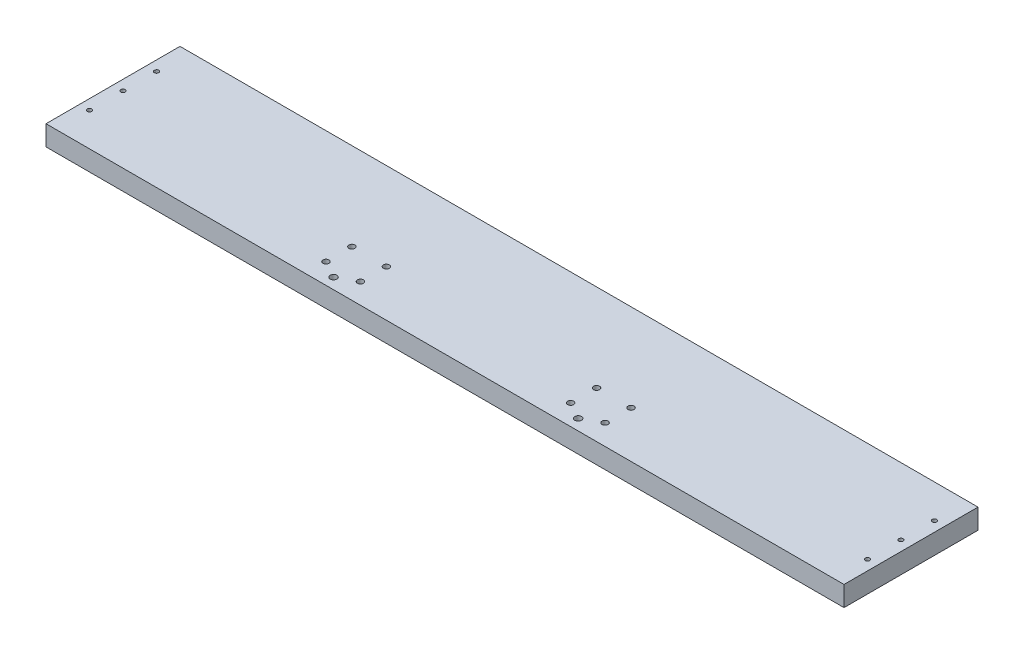
ISO-10303-21;
HEADER;
FILE_DESCRIPTION(('STEP AP214'),'2;1');
FILE_NAME('part.step','',(''),(''),'','','');
FILE_SCHEMA(('AUTOMOTIVE_DESIGN { 1 0 10303 214 1 1 1 1 }'));
ENDSEC;
DATA;
#1=APPLICATION_CONTEXT('core data for automotive mechanical design processes');
#2=APPLICATION_PROTOCOL_DEFINITION('international standard','automotive_design',2000,#1);
#3=PRODUCT_CONTEXT('',#1,'mechanical');
#4=PRODUCT('Part','Part','',(#3));
#5=PRODUCT_RELATED_PRODUCT_CATEGORY('part','',(#4));
#6=PRODUCT_DEFINITION_FORMATION('','',#4);
#7=PRODUCT_DEFINITION_CONTEXT('part definition',#1,'design');
#8=PRODUCT_DEFINITION('design','',#6,#7);
#9=PRODUCT_DEFINITION_SHAPE('','',#8);
#10=(LENGTH_UNIT() NAMED_UNIT(*) SI_UNIT(.MILLI.,.METRE.));
#11=(NAMED_UNIT(*) PLANE_ANGLE_UNIT() SI_UNIT($,.RADIAN.));
#12=(NAMED_UNIT(*) SI_UNIT($,.STERADIAN.) SOLID_ANGLE_UNIT());
#13=UNCERTAINTY_MEASURE_WITH_UNIT(LENGTH_MEASURE(1.E-05),#10,'distance_accuracy_value','');
#14=(GEOMETRIC_REPRESENTATION_CONTEXT(3) GLOBAL_UNCERTAINTY_ASSIGNED_CONTEXT((#13)) GLOBAL_UNIT_ASSIGNED_CONTEXT((#10,
#11,#12)) REPRESENTATION_CONTEXT('',''));
#15=CARTESIAN_POINT('',(0.,0.,0.));
#16=DIRECTION('',(0.,0.,1.));
#17=DIRECTION('',(1.,0.,0.));
#18=AXIS2_PLACEMENT_3D('',#15,#16,#17);
#19=CARTESIAN_POINT('',(0.,19.05,0.));
#20=DIRECTION('',(1.,0.,0.));
#21=DIRECTION('',(0.,0.,-1.));
#22=AXIS2_PLACEMENT_3D('',#19,#20,#21);
#23=PLANE('',#22);
#24=DIRECTION('',(0.,0.,1.));
#25=VECTOR('',#24,1.);
#26=CARTESIAN_POINT('',(0.,0.,0.));
#27=LINE('',#26,#25);
#28=CARTESIAN_POINT('',(0.,0.,-127.));
#29=VERTEX_POINT('',#28);
#30=CARTESIAN_POINT('',(0.,0.,0.));
#31=VERTEX_POINT('',#30);
#32=EDGE_CURVE('E96',#29,#31,#27,.T.);
#33=ORIENTED_EDGE('',*,*,#32,.T.);
#34=DIRECTION('',(0.,-1.,0.));
#35=VECTOR('',#34,1.);
#36=CARTESIAN_POINT('',(0.,19.05,0.));
#37=LINE('',#36,#35);
#38=CARTESIAN_POINT('',(0.,19.05,0.));
#39=VERTEX_POINT('',#38);
#40=EDGE_CURVE('E11',#39,#31,#37,.T.);
#41=ORIENTED_EDGE('',*,*,#40,.F.);
#42=DIRECTION('',(0.,0.,1.));
#43=VECTOR('',#42,1.);
#44=CARTESIAN_POINT('',(0.,19.05,0.));
#45=LINE('',#44,#43);
#46=CARTESIAN_POINT('',(0.,19.05,-127.));
#47=VERTEX_POINT('',#46);
#48=EDGE_CURVE('E84',#47,#39,#45,.T.);
#49=ORIENTED_EDGE('',*,*,#48,.F.);
#50=DIRECTION('',(0.,-1.,0.));
#51=VECTOR('',#50,1.);
#52=CARTESIAN_POINT('',(0.,19.05,-127.));
#53=LINE('',#52,#51);
#54=EDGE_CURVE('E92',#47,#29,#53,.T.);
#55=ORIENTED_EDGE('',*,*,#54,.T.);
#56=EDGE_LOOP('',(#33,#41,#49,#55));
#57=FACE_BOUND('',#56,.T.);
#58=ADVANCED_FACE('F33',(#57),#23,.F.);
#59=CARTESIAN_POINT('',(0.,19.05,0.));
#60=DIRECTION('',(0.,0.,-1.));
#61=DIRECTION('',(-1.,0.,0.));
#62=AXIS2_PLACEMENT_3D('',#59,#60,#61);
#63=PLANE('',#62);
#64=DIRECTION('',(1.,0.,0.));
#65=VECTOR('',#64,1.);
#66=CARTESIAN_POINT('',(0.,0.,0.));
#67=LINE('',#66,#65);
#68=CARTESIAN_POINT('',(756.412,0.,0.));
#69=VERTEX_POINT('',#68);
#70=EDGE_CURVE('E88',#31,#69,#67,.T.);
#71=ORIENTED_EDGE('',*,*,#70,.T.);
#72=DIRECTION('',(0.,-1.,0.));
#73=VECTOR('',#72,1.);
#74=CARTESIAN_POINT('',(756.412,19.05,0.));
#75=LINE('',#74,#73);
#76=CARTESIAN_POINT('',(756.412,19.05,0.));
#77=VERTEX_POINT('',#76);
#78=EDGE_CURVE('E41',#77,#69,#75,.T.);
#79=ORIENTED_EDGE('',*,*,#78,.F.);
#80=DIRECTION('',(1.,0.,0.));
#81=VECTOR('',#80,1.);
#82=CARTESIAN_POINT('',(0.,19.05,0.));
#83=LINE('',#82,#81);
#84=EDGE_CURVE('E79',#39,#77,#83,.T.);
#85=ORIENTED_EDGE('',*,*,#84,.F.);
#86=ORIENTED_EDGE('',*,*,#40,.T.);
#87=EDGE_LOOP('',(#71,#79,#85,#86));
#88=FACE_BOUND('',#87,.T.);
#89=ADVANCED_FACE('F87',(#88),#63,.F.);
#90=CARTESIAN_POINT('',(756.412,19.05,0.));
#91=DIRECTION('',(-1.,0.,0.));
#92=DIRECTION('',(0.,0.,1.));
#93=AXIS2_PLACEMENT_3D('',#90,#91,#92);
#94=PLANE('',#93);
#95=DIRECTION('',(0.,0.,-1.));
#96=VECTOR('',#95,1.);
#97=CARTESIAN_POINT('',(756.412,0.,0.));
#98=LINE('',#97,#96);
#99=CARTESIAN_POINT('',(756.412,0.,-127.));
#100=VERTEX_POINT('',#99);
#101=EDGE_CURVE('E66',#69,#100,#98,.T.);
#102=ORIENTED_EDGE('',*,*,#101,.T.);
#103=DIRECTION('',(0.,-1.,0.));
#104=VECTOR('',#103,1.);
#105=CARTESIAN_POINT('',(756.412,19.05,-127.));
#106=LINE('',#105,#104);
#107=CARTESIAN_POINT('',(756.412,19.05,-127.));
#108=VERTEX_POINT('',#107);
#109=EDGE_CURVE('E89',#108,#100,#106,.T.);
#110=ORIENTED_EDGE('',*,*,#109,.F.);
#111=DIRECTION('',(0.,0.,-1.));
#112=VECTOR('',#111,1.);
#113=CARTESIAN_POINT('',(756.412,19.05,0.));
#114=LINE('',#113,#112);
#115=EDGE_CURVE('E82',#77,#108,#114,.T.);
#116=ORIENTED_EDGE('',*,*,#115,.F.);
#117=ORIENTED_EDGE('',*,*,#78,.T.);
#118=EDGE_LOOP('',(#102,#110,#116,#117));
#119=FACE_BOUND('',#118,.T.);
#120=ADVANCED_FACE('F90',(#119),#94,.F.);
#121=CARTESIAN_POINT('',(0.,19.05,-127.));
#122=DIRECTION('',(0.,0.,1.));
#123=DIRECTION('',(1.,0.,0.));
#124=AXIS2_PLACEMENT_3D('',#121,#122,#123);
#125=PLANE('',#124);
#126=DIRECTION('',(-1.,0.,0.));
#127=VECTOR('',#126,1.);
#128=CARTESIAN_POINT('',(0.,0.,-127.));
#129=LINE('',#128,#127);
#130=EDGE_CURVE('E72',#100,#29,#129,.T.);
#131=ORIENTED_EDGE('',*,*,#130,.T.);
#132=ORIENTED_EDGE('',*,*,#54,.F.);
#133=DIRECTION('',(-1.,0.,0.));
#134=VECTOR('',#133,1.);
#135=CARTESIAN_POINT('',(0.,19.05,-127.));
#136=LINE('',#135,#134);
#137=EDGE_CURVE('E49',#108,#47,#136,.T.);
#138=ORIENTED_EDGE('',*,*,#137,.F.);
#139=ORIENTED_EDGE('',*,*,#109,.T.);
#140=EDGE_LOOP('',(#131,#132,#138,#139));
#141=FACE_BOUND('',#140,.T.);
#142=ADVANCED_FACE('F104',(#141),#125,.F.);
#143=CARTESIAN_POINT('',(0.,19.05,0.));
#144=DIRECTION('',(0.,-1.,0.));
#145=DIRECTION('',(0.,0.,-1.));
#146=AXIS2_PLACEMENT_3D('',#143,#144,#145);
#147=PLANE('',#146);
#148=CARTESIAN_POINT('',(746.887,19.05,-95.25));
#149=DIRECTION('',(0.,1.,0.));
#150=DIRECTION('',(0.,0.,-1.));
#151=AXIS2_PLACEMENT_3D('',#148,#149,#150);
#152=CIRCLE('',#151,2.08280000000001);
#153=CARTESIAN_POINT('',(746.887,19.05,-97.3328));
#154=VERTEX_POINT('',#153);
#155=EDGE_CURVE('E179',#154,#154,#152,.T.);
#156=ORIENTED_EDGE('',*,*,#155,.F.);
#157=EDGE_LOOP('',(#156));
#158=FACE_BOUND('',#157,.T.);
#159=CARTESIAN_POINT('',(746.887,19.05,-63.5));
#160=DIRECTION('',(0.,1.,0.));
#161=DIRECTION('',(0.,0.,-1.));
#162=AXIS2_PLACEMENT_3D('',#159,#160,#161);
#163=CIRCLE('',#162,2.08280000000001);
#164=CARTESIAN_POINT('',(746.887,19.05,-65.5828));
#165=VERTEX_POINT('',#164);
#166=EDGE_CURVE('E185',#165,#165,#163,.T.);
#167=ORIENTED_EDGE('',*,*,#166,.F.);
#168=EDGE_LOOP('',(#167));
#169=FACE_BOUND('',#168,.T.);
#170=CARTESIAN_POINT('',(746.887,19.05,-31.75));
#171=DIRECTION('',(0.,1.,0.));
#172=DIRECTION('',(0.,0.,-1.));
#173=AXIS2_PLACEMENT_3D('',#170,#171,#172);
#174=CIRCLE('',#173,2.08280000000001);
#175=CARTESIAN_POINT('',(746.887,19.05,-33.8328));
#176=VERTEX_POINT('',#175);
#177=EDGE_CURVE('E191',#176,#176,#174,.T.);
#178=ORIENTED_EDGE('',*,*,#177,.F.);
#179=EDGE_LOOP('',(#178));
#180=FACE_BOUND('',#179,.T.);
#181=CARTESIAN_POINT('',(9.525,19.05,-31.75));
#182=DIRECTION('',(0.,1.,0.));
#183=DIRECTION('',(0.,0.,1.));
#184=AXIS2_PLACEMENT_3D('',#181,#182,#183);
#185=CIRCLE('',#184,2.0828);
#186=CARTESIAN_POINT('',(9.525,19.05,-29.6672));
#187=VERTEX_POINT('',#186);
#188=EDGE_CURVE('E197',#187,#187,#185,.T.);
#189=ORIENTED_EDGE('',*,*,#188,.F.);
#190=EDGE_LOOP('',(#189));
#191=FACE_BOUND('',#190,.T.);
#192=CARTESIAN_POINT('',(9.525,19.05,-63.5));
#193=DIRECTION('',(0.,1.,0.));
#194=DIRECTION('',(0.,0.,1.));
#195=AXIS2_PLACEMENT_3D('',#192,#193,#194);
#196=CIRCLE('',#195,2.0828);
#197=CARTESIAN_POINT('',(9.525,19.05,-61.4172));
#198=VERTEX_POINT('',#197);
#199=EDGE_CURVE('E173',#198,#198,#196,.T.);
#200=ORIENTED_EDGE('',*,*,#199,.F.);
#201=EDGE_LOOP('',(#200));
#202=FACE_BOUND('',#201,.T.);
#203=CARTESIAN_POINT('',(9.525,19.05,-95.25));
#204=DIRECTION('',(0.,1.,0.));
#205=DIRECTION('',(0.,0.,1.));
#206=AXIS2_PLACEMENT_3D('',#203,#204,#205);
#207=CIRCLE('',#206,2.0828);
#208=CARTESIAN_POINT('',(9.525,19.05,-93.1672));
#209=VERTEX_POINT('',#208);
#210=EDGE_CURVE('E162',#209,#209,#207,.T.);
#211=ORIENTED_EDGE('',*,*,#210,.F.);
#212=EDGE_LOOP('',(#211));
#213=FACE_BOUND('',#212,.T.);
#214=CARTESIAN_POINT('',(494.157,19.05,-10.31875));
#215=DIRECTION('',(0.,1.,0.));
#216=DIRECTION('',(0.,0.,1.));
#217=AXIS2_PLACEMENT_3D('',#214,#215,#216);
#218=CIRCLE('',#217,3.17499999999997);
#219=CARTESIAN_POINT('',(494.157,19.05,-7.14375000000008));
#220=VERTEX_POINT('',#219);
#221=EDGE_CURVE('E144',#220,#220,#218,.T.);
#222=ORIENTED_EDGE('',*,*,#221,.F.);
#223=EDGE_LOOP('',(#222));
#224=FACE_BOUND('',#223,.T.);
#225=CARTESIAN_POINT('',(262.255,19.05,-10.31875));
#226=DIRECTION('',(0.,1.,0.));
#227=DIRECTION('',(0.,0.,1.));
#228=AXIS2_PLACEMENT_3D('',#225,#226,#227);
#229=CIRCLE('',#228,3.17499999999997);
#230=CARTESIAN_POINT('',(262.255,19.05,-7.14375000000008));
#231=VERTEX_POINT('',#230);
#232=EDGE_CURVE('E161',#231,#231,#229,.T.);
#233=ORIENTED_EDGE('',*,*,#232,.F.);
#234=EDGE_LOOP('',(#233));
#235=FACE_BOUND('',#234,.T.);
#236=CARTESIAN_POINT('',(477.83115,19.05,-19.46275));
#237=DIRECTION('',(0.,1.,0.));
#238=DIRECTION('',(0.,0.,1.));
#239=AXIS2_PLACEMENT_3D('',#236,#237,#238);
#240=CIRCLE('',#239,2.85114999999997);
#241=CARTESIAN_POINT('',(477.83115,19.05,-16.6116000000001));
#242=VERTEX_POINT('',#241);
#243=EDGE_CURVE('E131',#242,#242,#240,.T.);
#244=ORIENTED_EDGE('',*,*,#243,.F.);
#245=EDGE_LOOP('',(#244));
#246=FACE_BOUND('',#245,.T.);
#247=CARTESIAN_POINT('',(245.92915,19.05,-44.03725));
#248=DIRECTION('',(0.,1.,0.));
#249=DIRECTION('',(0.,0.,1.));
#250=AXIS2_PLACEMENT_3D('',#247,#248,#249);
#251=CIRCLE('',#250,2.85114999998112);
#252=CARTESIAN_POINT('',(245.92915,19.05,-41.1861000000189));
#253=VERTEX_POINT('',#252);
#254=EDGE_CURVE('E120',#253,#253,#251,.T.);
#255=ORIENTED_EDGE('',*,*,#254,.F.);
#256=EDGE_LOOP('',(#255));
#257=FACE_BOUND('',#256,.T.);
#258=CARTESIAN_POINT('',(278.58085,19.05,-44.03725));
#259=DIRECTION('',(0.,1.,0.));
#260=DIRECTION('',(0.,0.,1.));
#261=AXIS2_PLACEMENT_3D('',#258,#259,#260);
#262=CIRCLE('',#261,2.85114999998106);
#263=CARTESIAN_POINT('',(278.58085,19.05,-41.186100000019));
#264=VERTEX_POINT('',#263);
#265=EDGE_CURVE('E119',#264,#264,#262,.T.);
#266=ORIENTED_EDGE('',*,*,#265,.F.);
#267=EDGE_LOOP('',(#266));
#268=FACE_BOUND('',#267,.T.);
#269=CARTESIAN_POINT('',(278.58085,19.05,-19.46275));
#270=DIRECTION('',(0.,1.,0.));
#271=DIRECTION('',(0.,0.,1.));
#272=AXIS2_PLACEMENT_3D('',#269,#270,#271);
#273=CIRCLE('',#272,2.85114999998106);
#274=CARTESIAN_POINT('',(278.58085,19.05,-16.611600000019));
#275=VERTEX_POINT('',#274);
#276=EDGE_CURVE('E113',#275,#275,#273,.T.);
#277=ORIENTED_EDGE('',*,*,#276,.F.);
#278=EDGE_LOOP('',(#277));
#279=FACE_BOUND('',#278,.T.);
#280=CARTESIAN_POINT('',(510.48285,19.05,-19.46275));
#281=DIRECTION('',(0.,1.,0.));
#282=DIRECTION('',(0.,0.,1.));
#283=AXIS2_PLACEMENT_3D('',#280,#281,#282);
#284=CIRCLE('',#283,2.85114999999998);
#285=CARTESIAN_POINT('',(510.48285,19.05,-16.6116000000001));
#286=VERTEX_POINT('',#285);
#287=EDGE_CURVE('E132',#286,#286,#284,.T.);
#288=ORIENTED_EDGE('',*,*,#287,.F.);
#289=EDGE_LOOP('',(#288));
#290=FACE_BOUND('',#289,.T.);
#291=CARTESIAN_POINT('',(510.48285,19.05,-44.03725));
#292=DIRECTION('',(0.,1.,0.));
#293=DIRECTION('',(0.,0.,1.));
#294=AXIS2_PLACEMENT_3D('',#291,#292,#293);
#295=CIRCLE('',#294,2.85114999999998);
#296=CARTESIAN_POINT('',(510.48285,19.05,-41.1861000000001));
#297=VERTEX_POINT('',#296);
#298=EDGE_CURVE('E150',#297,#297,#295,.T.);
#299=ORIENTED_EDGE('',*,*,#298,.F.);
#300=EDGE_LOOP('',(#299));
#301=FACE_BOUND('',#300,.T.);
#302=CARTESIAN_POINT('',(477.83115,19.05,-44.03725));
#303=DIRECTION('',(0.,1.,0.));
#304=DIRECTION('',(0.,0.,1.));
#305=AXIS2_PLACEMENT_3D('',#302,#303,#304);
#306=CIRCLE('',#305,2.85114999999997);
#307=CARTESIAN_POINT('',(477.83115,19.05,-41.1861000000001));
#308=VERTEX_POINT('',#307);
#309=EDGE_CURVE('E143',#308,#308,#306,.T.);
#310=ORIENTED_EDGE('',*,*,#309,.F.);
#311=EDGE_LOOP('',(#310));
#312=FACE_BOUND('',#311,.T.);
#313=CARTESIAN_POINT('',(245.92915,19.05,-19.46275));
#314=DIRECTION('',(0.,1.,0.));
#315=DIRECTION('',(0.,0.,1.));
#316=AXIS2_PLACEMENT_3D('',#313,#314,#315);
#317=CIRCLE('',#316,2.85114999998112);
#318=CARTESIAN_POINT('',(245.92915,19.05,-16.6116000000189));
#319=VERTEX_POINT('',#318);
#320=EDGE_CURVE('E99',#319,#319,#317,.T.);
#321=ORIENTED_EDGE('',*,*,#320,.F.);
#322=EDGE_LOOP('',(#321));
#323=FACE_BOUND('',#322,.T.);
#324=ORIENTED_EDGE('',*,*,#48,.T.);
#325=ORIENTED_EDGE('',*,*,#84,.T.);
#326=ORIENTED_EDGE('',*,*,#115,.T.);
#327=ORIENTED_EDGE('',*,*,#137,.T.);
#328=EDGE_LOOP('',(#324,#325,#326,#327));
#329=FACE_BOUND('',#328,.T.);
#330=ADVANCED_FACE('F80',(#158,#169,#180,#191,#202,#213,#224,#235,#246,#257,#268,#279,#290,#301,
#312,#323,#329),#147,.F.);
#331=CARTESIAN_POINT('',(0.,0.,0.));
#332=DIRECTION('',(0.,-1.,0.));
#333=DIRECTION('',(0.,0.,-1.));
#334=AXIS2_PLACEMENT_3D('',#331,#332,#333);
#335=PLANE('',#334);
#336=CARTESIAN_POINT('',(746.887,0.,-95.25));
#337=DIRECTION('',(0.,-1.,0.));
#338=DIRECTION('',(0.,0.,-1.));
#339=AXIS2_PLACEMENT_3D('',#336,#337,#338);
#340=CIRCLE('',#339,2.08280000000001);
#341=CARTESIAN_POINT('',(746.887,0.,-97.3328));
#342=VERTEX_POINT('',#341);
#343=EDGE_CURVE('E176',#342,#342,#340,.F.);
#344=ORIENTED_EDGE('',*,*,#343,.T.);
#345=EDGE_LOOP('',(#344));
#346=FACE_BOUND('',#345,.T.);
#347=CARTESIAN_POINT('',(746.887,0.,-63.5));
#348=DIRECTION('',(0.,-1.,0.));
#349=DIRECTION('',(0.,0.,-1.));
#350=AXIS2_PLACEMENT_3D('',#347,#348,#349);
#351=CIRCLE('',#350,2.08280000000001);
#352=CARTESIAN_POINT('',(746.887,0.,-65.5828));
#353=VERTEX_POINT('',#352);
#354=EDGE_CURVE('E182',#353,#353,#351,.F.);
#355=ORIENTED_EDGE('',*,*,#354,.T.);
#356=EDGE_LOOP('',(#355));
#357=FACE_BOUND('',#356,.T.);
#358=CARTESIAN_POINT('',(746.887,0.,-31.75));
#359=DIRECTION('',(0.,-1.,0.));
#360=DIRECTION('',(0.,0.,-1.));
#361=AXIS2_PLACEMENT_3D('',#358,#359,#360);
#362=CIRCLE('',#361,2.08280000000001);
#363=CARTESIAN_POINT('',(746.887,0.,-33.8328));
#364=VERTEX_POINT('',#363);
#365=EDGE_CURVE('E188',#364,#364,#362,.F.);
#366=ORIENTED_EDGE('',*,*,#365,.T.);
#367=EDGE_LOOP('',(#366));
#368=FACE_BOUND('',#367,.T.);
#369=CARTESIAN_POINT('',(9.525,0.,-31.75));
#370=DIRECTION('',(0.,-1.,0.));
#371=DIRECTION('',(0.,0.,-1.));
#372=AXIS2_PLACEMENT_3D('',#369,#370,#371);
#373=CIRCLE('',#372,2.0828);
#374=CARTESIAN_POINT('',(9.525,0.,-33.8328));
#375=VERTEX_POINT('',#374);
#376=EDGE_CURVE('E194',#375,#375,#373,.F.);
#377=ORIENTED_EDGE('',*,*,#376,.T.);
#378=EDGE_LOOP('',(#377));
#379=FACE_BOUND('',#378,.T.);
#380=CARTESIAN_POINT('',(9.525,0.,-63.5));
#381=DIRECTION('',(0.,-1.,0.));
#382=DIRECTION('',(0.,0.,-1.));
#383=AXIS2_PLACEMENT_3D('',#380,#381,#382);
#384=CIRCLE('',#383,2.0828);
#385=CARTESIAN_POINT('',(9.525,0.,-65.5828));
#386=VERTEX_POINT('',#385);
#387=EDGE_CURVE('E200',#386,#386,#384,.F.);
#388=ORIENTED_EDGE('',*,*,#387,.T.);
#389=EDGE_LOOP('',(#388));
#390=FACE_BOUND('',#389,.T.);
#391=CARTESIAN_POINT('',(9.525,0.,-95.25));
#392=DIRECTION('',(0.,-1.,0.));
#393=DIRECTION('',(0.,0.,-1.));
#394=AXIS2_PLACEMENT_3D('',#391,#392,#393);
#395=CIRCLE('',#394,2.0828);
#396=CARTESIAN_POINT('',(9.525,0.,-97.3328));
#397=VERTEX_POINT('',#396);
#398=EDGE_CURVE('E170',#397,#397,#395,.F.);
#399=ORIENTED_EDGE('',*,*,#398,.T.);
#400=EDGE_LOOP('',(#399));
#401=FACE_BOUND('',#400,.T.);
#402=CARTESIAN_POINT('',(494.157,0.,-10.31875));
#403=DIRECTION('',(0.,-1.,0.));
#404=DIRECTION('',(0.,0.,-1.));
#405=AXIS2_PLACEMENT_3D('',#402,#403,#404);
#406=CIRCLE('',#405,3.17499999999997);
#407=CARTESIAN_POINT('',(494.157,0.,-13.49375));
#408=VERTEX_POINT('',#407);
#409=EDGE_CURVE('E165',#408,#408,#406,.F.);
#410=ORIENTED_EDGE('',*,*,#409,.T.);
#411=EDGE_LOOP('',(#410));
#412=FACE_BOUND('',#411,.T.);
#413=CARTESIAN_POINT('',(262.255,0.,-10.31875));
#414=DIRECTION('',(0.,-1.,0.));
#415=DIRECTION('',(0.,0.,-1.));
#416=AXIS2_PLACEMENT_3D('',#413,#414,#415);
#417=CIRCLE('',#416,3.17499999999997);
#418=CARTESIAN_POINT('',(262.255,0.,-13.49375));
#419=VERTEX_POINT('',#418);
#420=EDGE_CURVE('E158',#419,#419,#417,.F.);
#421=ORIENTED_EDGE('',*,*,#420,.T.);
#422=EDGE_LOOP('',(#421));
#423=FACE_BOUND('',#422,.T.);
#424=CARTESIAN_POINT('',(477.83115,0.,-19.46275));
#425=DIRECTION('',(0.,-1.,0.));
#426=DIRECTION('',(0.,0.,-1.));
#427=AXIS2_PLACEMENT_3D('',#424,#425,#426);
#428=CIRCLE('',#427,2.85114999999997);
#429=CARTESIAN_POINT('',(477.83115,0.,-22.3139));
#430=VERTEX_POINT('',#429);
#431=EDGE_CURVE('E128',#430,#430,#428,.F.);
#432=ORIENTED_EDGE('',*,*,#431,.T.);
#433=EDGE_LOOP('',(#432));
#434=FACE_BOUND('',#433,.T.);
#435=CARTESIAN_POINT('',(245.92915,0.,-44.03725));
#436=DIRECTION('',(0.,-1.,0.));
#437=DIRECTION('',(0.,0.,-1.));
#438=AXIS2_PLACEMENT_3D('',#435,#436,#437);
#439=CIRCLE('',#438,2.85114999998112);
#440=CARTESIAN_POINT('',(245.92915,0.,-46.8883999999812));
#441=VERTEX_POINT('',#440);
#442=EDGE_CURVE('E135',#441,#441,#439,.F.);
#443=ORIENTED_EDGE('',*,*,#442,.T.);
#444=EDGE_LOOP('',(#443));
#445=FACE_BOUND('',#444,.T.);
#446=CARTESIAN_POINT('',(278.58085,0.,-44.03725));
#447=DIRECTION('',(0.,-1.,0.));
#448=DIRECTION('',(0.,0.,-1.));
#449=AXIS2_PLACEMENT_3D('',#446,#447,#448);
#450=CIRCLE('',#449,2.85114999998106);
#451=CARTESIAN_POINT('',(278.58085,0.,-46.8883999999811));
#452=VERTEX_POINT('',#451);
#453=EDGE_CURVE('E116',#452,#452,#450,.F.);
#454=ORIENTED_EDGE('',*,*,#453,.T.);
#455=EDGE_LOOP('',(#454));
#456=FACE_BOUND('',#455,.T.);
#457=CARTESIAN_POINT('',(278.58085,0.,-19.46275));
#458=DIRECTION('',(0.,-1.,0.));
#459=DIRECTION('',(0.,0.,-1.));
#460=AXIS2_PLACEMENT_3D('',#457,#458,#459);
#461=CIRCLE('',#460,2.85114999998106);
#462=CARTESIAN_POINT('',(278.58085,0.,-22.3138999999811));
#463=VERTEX_POINT('',#462);
#464=EDGE_CURVE('E123',#463,#463,#461,.F.);
#465=ORIENTED_EDGE('',*,*,#464,.T.);
#466=EDGE_LOOP('',(#465));
#467=FACE_BOUND('',#466,.T.);
#468=CARTESIAN_POINT('',(510.48285,0.,-19.46275));
#469=DIRECTION('',(0.,-1.,0.));
#470=DIRECTION('',(0.,0.,-1.));
#471=AXIS2_PLACEMENT_3D('',#468,#469,#470);
#472=CIRCLE('',#471,2.85114999999998);
#473=CARTESIAN_POINT('',(510.48285,0.,-22.3139));
#474=VERTEX_POINT('',#473);
#475=EDGE_CURVE('E153',#474,#474,#472,.F.);
#476=ORIENTED_EDGE('',*,*,#475,.T.);
#477=EDGE_LOOP('',(#476));
#478=FACE_BOUND('',#477,.T.);
#479=CARTESIAN_POINT('',(510.48285,0.,-44.03725));
#480=DIRECTION('',(0.,-1.,0.));
#481=DIRECTION('',(0.,0.,-1.));
#482=AXIS2_PLACEMENT_3D('',#479,#480,#481);
#483=CIRCLE('',#482,2.85114999999998);
#484=CARTESIAN_POINT('',(510.48285,0.,-46.8884));
#485=VERTEX_POINT('',#484);
#486=EDGE_CURVE('E147',#485,#485,#483,.F.);
#487=ORIENTED_EDGE('',*,*,#486,.T.);
#488=EDGE_LOOP('',(#487));
#489=FACE_BOUND('',#488,.T.);
#490=CARTESIAN_POINT('',(477.83115,0.,-44.03725));
#491=DIRECTION('',(0.,-1.,0.));
#492=DIRECTION('',(0.,0.,-1.));
#493=AXIS2_PLACEMENT_3D('',#490,#491,#492);
#494=CIRCLE('',#493,2.85114999999997);
#495=CARTESIAN_POINT('',(477.83115,0.,-46.8884));
#496=VERTEX_POINT('',#495);
#497=EDGE_CURVE('E140',#496,#496,#494,.F.);
#498=ORIENTED_EDGE('',*,*,#497,.T.);
#499=EDGE_LOOP('',(#498));
#500=FACE_BOUND('',#499,.T.);
#501=CARTESIAN_POINT('',(245.92915,0.,-19.46275));
#502=DIRECTION('',(0.,-1.,0.));
#503=DIRECTION('',(0.,0.,-1.));
#504=AXIS2_PLACEMENT_3D('',#501,#502,#503);
#505=CIRCLE('',#504,2.85114999998112);
#506=CARTESIAN_POINT('',(245.92915,0.,-22.3138999999812));
#507=VERTEX_POINT('',#506);
#508=EDGE_CURVE('E110',#507,#507,#505,.F.);
#509=ORIENTED_EDGE('',*,*,#508,.T.);
#510=EDGE_LOOP('',(#509));
#511=FACE_BOUND('',#510,.T.);
#512=ORIENTED_EDGE('',*,*,#32,.F.);
#513=ORIENTED_EDGE('',*,*,#130,.F.);
#514=ORIENTED_EDGE('',*,*,#101,.F.);
#515=ORIENTED_EDGE('',*,*,#70,.F.);
#516=EDGE_LOOP('',(#512,#513,#514,#515));
#517=FACE_BOUND('',#516,.T.);
#518=ADVANCED_FACE('F107',(#346,#357,#368,#379,#390,#401,#412,#423,#434,#445,#456,#467,#478,
#489,#500,#511,#517),#335,.T.);
#519=CARTESIAN_POINT('',(245.92915,-0.001000000000001,-19.46275));
#520=DIRECTION('',(0.,1.,0.));
#521=DIRECTION('',(0.,0.,1.));
#522=AXIS2_PLACEMENT_3D('',#519,#520,#521);
#523=CYLINDRICAL_SURFACE('',#522,2.85114999998112);
#524=ORIENTED_EDGE('',*,*,#508,.F.);
#525=EDGE_LOOP('',(#524));
#526=FACE_BOUND('',#525,.T.);
#527=ORIENTED_EDGE('',*,*,#320,.T.);
#528=EDGE_LOOP('',(#527));
#529=FACE_BOUND('',#528,.T.);
#530=ADVANCED_FACE('F234',(#526,#529),#523,.F.);
#531=CARTESIAN_POINT('',(477.83115,-0.001000000000001,-44.03725));
#532=DIRECTION('',(0.,1.,0.));
#533=DIRECTION('',(0.,0.,1.));
#534=AXIS2_PLACEMENT_3D('',#531,#532,#533);
#535=CYLINDRICAL_SURFACE('',#534,2.85114999999997);
#536=ORIENTED_EDGE('',*,*,#497,.F.);
#537=EDGE_LOOP('',(#536));
#538=FACE_BOUND('',#537,.T.);
#539=ORIENTED_EDGE('',*,*,#309,.T.);
#540=EDGE_LOOP('',(#539));
#541=FACE_BOUND('',#540,.T.);
#542=ADVANCED_FACE('F236',(#538,#541),#535,.F.);
#543=CARTESIAN_POINT('',(510.48285,-0.001000000000001,-44.03725));
#544=DIRECTION('',(0.,1.,0.));
#545=DIRECTION('',(0.,0.,1.));
#546=AXIS2_PLACEMENT_3D('',#543,#544,#545);
#547=CYLINDRICAL_SURFACE('',#546,2.85114999999998);
#548=ORIENTED_EDGE('',*,*,#486,.F.);
#549=EDGE_LOOP('',(#548));
#550=FACE_BOUND('',#549,.T.);
#551=ORIENTED_EDGE('',*,*,#298,.T.);
#552=EDGE_LOOP('',(#551));
#553=FACE_BOUND('',#552,.T.);
#554=ADVANCED_FACE('F243',(#550,#553),#547,.F.);
#555=CARTESIAN_POINT('',(510.48285,-0.001000000000001,-19.46275));
#556=DIRECTION('',(0.,1.,0.));
#557=DIRECTION('',(0.,0.,1.));
#558=AXIS2_PLACEMENT_3D('',#555,#556,#557);
#559=CYLINDRICAL_SURFACE('',#558,2.85114999999998);
#560=ORIENTED_EDGE('',*,*,#475,.F.);
#561=EDGE_LOOP('',(#560));
#562=FACE_BOUND('',#561,.T.);
#563=ORIENTED_EDGE('',*,*,#287,.T.);
#564=EDGE_LOOP('',(#563));
#565=FACE_BOUND('',#564,.T.);
#566=ADVANCED_FACE('F350',(#562,#565),#559,.F.);
#567=CARTESIAN_POINT('',(278.58085,-0.001000000000001,-19.46275));
#568=DIRECTION('',(0.,1.,0.));
#569=DIRECTION('',(0.,0.,1.));
#570=AXIS2_PLACEMENT_3D('',#567,#568,#569);
#571=CYLINDRICAL_SURFACE('',#570,2.85114999998106);
#572=ORIENTED_EDGE('',*,*,#464,.F.);
#573=EDGE_LOOP('',(#572));
#574=FACE_BOUND('',#573,.T.);
#575=ORIENTED_EDGE('',*,*,#276,.T.);
#576=EDGE_LOOP('',(#575));
#577=FACE_BOUND('',#576,.T.);
#578=ADVANCED_FACE('F353',(#574,#577),#571,.F.);
#579=CARTESIAN_POINT('',(278.58085,-0.001000000000001,-44.03725));
#580=DIRECTION('',(0.,1.,0.));
#581=DIRECTION('',(0.,0.,1.));
#582=AXIS2_PLACEMENT_3D('',#579,#580,#581);
#583=CYLINDRICAL_SURFACE('',#582,2.85114999998106);
#584=ORIENTED_EDGE('',*,*,#453,.F.);
#585=EDGE_LOOP('',(#584));
#586=FACE_BOUND('',#585,.T.);
#587=ORIENTED_EDGE('',*,*,#265,.T.);
#588=EDGE_LOOP('',(#587));
#589=FACE_BOUND('',#588,.T.);
#590=ADVANCED_FACE('F361',(#586,#589),#583,.F.);
#591=CARTESIAN_POINT('',(245.92915,-0.001000000000001,-44.03725));
#592=DIRECTION('',(0.,1.,0.));
#593=DIRECTION('',(0.,0.,1.));
#594=AXIS2_PLACEMENT_3D('',#591,#592,#593);
#595=CYLINDRICAL_SURFACE('',#594,2.85114999998112);
#596=ORIENTED_EDGE('',*,*,#442,.F.);
#597=EDGE_LOOP('',(#596));
#598=FACE_BOUND('',#597,.T.);
#599=ORIENTED_EDGE('',*,*,#254,.T.);
#600=EDGE_LOOP('',(#599));
#601=FACE_BOUND('',#600,.T.);
#602=ADVANCED_FACE('F358',(#598,#601),#595,.F.);
#603=CARTESIAN_POINT('',(477.83115,-0.001000000000001,-19.46275));
#604=DIRECTION('',(0.,1.,0.));
#605=DIRECTION('',(0.,0.,1.));
#606=AXIS2_PLACEMENT_3D('',#603,#604,#605);
#607=CYLINDRICAL_SURFACE('',#606,2.85114999999997);
#608=ORIENTED_EDGE('',*,*,#431,.F.);
#609=EDGE_LOOP('',(#608));
#610=FACE_BOUND('',#609,.T.);
#611=ORIENTED_EDGE('',*,*,#243,.T.);
#612=EDGE_LOOP('',(#611));
#613=FACE_BOUND('',#612,.T.);
#614=ADVANCED_FACE('F348',(#610,#613),#607,.F.);
#615=CARTESIAN_POINT('',(262.255,-0.001000000000001,-10.31875));
#616=DIRECTION('',(0.,1.,0.));
#617=DIRECTION('',(0.,0.,1.));
#618=AXIS2_PLACEMENT_3D('',#615,#616,#617);
#619=CYLINDRICAL_SURFACE('',#618,3.17499999999997);
#620=ORIENTED_EDGE('',*,*,#420,.F.);
#621=EDGE_LOOP('',(#620));
#622=FACE_BOUND('',#621,.T.);
#623=ORIENTED_EDGE('',*,*,#232,.T.);
#624=EDGE_LOOP('',(#623));
#625=FACE_BOUND('',#624,.T.);
#626=ADVANCED_FACE('F344',(#622,#625),#619,.F.);
#627=CARTESIAN_POINT('',(494.157,-0.001000000000001,-10.31875));
#628=DIRECTION('',(0.,1.,0.));
#629=DIRECTION('',(0.,0.,1.));
#630=AXIS2_PLACEMENT_3D('',#627,#628,#629);
#631=CYLINDRICAL_SURFACE('',#630,3.17499999999997);
#632=ORIENTED_EDGE('',*,*,#409,.F.);
#633=EDGE_LOOP('',(#632));
#634=FACE_BOUND('',#633,.T.);
#635=ORIENTED_EDGE('',*,*,#221,.T.);
#636=EDGE_LOOP('',(#635));
#637=FACE_BOUND('',#636,.T.);
#638=ADVANCED_FACE('F284',(#634,#637),#631,.F.);
#639=CARTESIAN_POINT('',(9.525,-0.001000000000001,-95.25));
#640=DIRECTION('',(0.,1.,0.));
#641=DIRECTION('',(0.,0.,1.));
#642=AXIS2_PLACEMENT_3D('',#639,#640,#641);
#643=CYLINDRICAL_SURFACE('',#642,2.0828);
#644=ORIENTED_EDGE('',*,*,#398,.F.);
#645=EDGE_LOOP('',(#644));
#646=FACE_BOUND('',#645,.T.);
#647=ORIENTED_EDGE('',*,*,#210,.T.);
#648=EDGE_LOOP('',(#647));
#649=FACE_BOUND('',#648,.T.);
#650=ADVANCED_FACE('F279',(#646,#649),#643,.F.);
#651=CARTESIAN_POINT('',(9.525,-0.001000000000001,-63.5));
#652=DIRECTION('',(0.,1.,0.));
#653=DIRECTION('',(0.,0.,1.));
#654=AXIS2_PLACEMENT_3D('',#651,#652,#653);
#655=CYLINDRICAL_SURFACE('',#654,2.0828);
#656=ORIENTED_EDGE('',*,*,#387,.F.);
#657=EDGE_LOOP('',(#656));
#658=FACE_BOUND('',#657,.T.);
#659=ORIENTED_EDGE('',*,*,#199,.T.);
#660=EDGE_LOOP('',(#659));
#661=FACE_BOUND('',#660,.T.);
#662=ADVANCED_FACE('F206',(#658,#661),#655,.F.);
#663=CARTESIAN_POINT('',(9.525,-0.001000000000001,-31.75));
#664=DIRECTION('',(0.,1.,0.));
#665=DIRECTION('',(0.,0.,1.));
#666=AXIS2_PLACEMENT_3D('',#663,#664,#665);
#667=CYLINDRICAL_SURFACE('',#666,2.0828);
#668=ORIENTED_EDGE('',*,*,#376,.F.);
#669=EDGE_LOOP('',(#668));
#670=FACE_BOUND('',#669,.T.);
#671=ORIENTED_EDGE('',*,*,#188,.T.);
#672=EDGE_LOOP('',(#671));
#673=FACE_BOUND('',#672,.T.);
#674=ADVANCED_FACE('F296',(#670,#673),#667,.F.);
#675=CARTESIAN_POINT('',(746.887,-0.001000000000001,-31.75));
#676=DIRECTION('',(0.,1.,0.));
#677=DIRECTION('',(0.,0.,1.));
#678=AXIS2_PLACEMENT_3D('',#675,#676,#677);
#679=CYLINDRICAL_SURFACE('',#678,2.08280000000001);
#680=ORIENTED_EDGE('',*,*,#365,.F.);
#681=EDGE_LOOP('',(#680));
#682=FACE_BOUND('',#681,.T.);
#683=ORIENTED_EDGE('',*,*,#177,.T.);
#684=EDGE_LOOP('',(#683));
#685=FACE_BOUND('',#684,.T.);
#686=ADVANCED_FACE('F306',(#682,#685),#679,.F.);
#687=CARTESIAN_POINT('',(746.887,-0.001000000000001,-63.5));
#688=DIRECTION('',(0.,1.,0.));
#689=DIRECTION('',(0.,0.,1.));
#690=AXIS2_PLACEMENT_3D('',#687,#688,#689);
#691=CYLINDRICAL_SURFACE('',#690,2.08280000000001);
#692=ORIENTED_EDGE('',*,*,#354,.F.);
#693=EDGE_LOOP('',(#692));
#694=FACE_BOUND('',#693,.T.);
#695=ORIENTED_EDGE('',*,*,#166,.T.);
#696=EDGE_LOOP('',(#695));
#697=FACE_BOUND('',#696,.T.);
#698=ADVANCED_FACE('F316',(#694,#697),#691,.F.);
#699=CARTESIAN_POINT('',(746.887,-0.001000000000001,-95.25));
#700=DIRECTION('',(0.,1.,0.));
#701=DIRECTION('',(0.,0.,1.));
#702=AXIS2_PLACEMENT_3D('',#699,#700,#701);
#703=CYLINDRICAL_SURFACE('',#702,2.08280000000001);
#704=ORIENTED_EDGE('',*,*,#343,.F.);
#705=EDGE_LOOP('',(#704));
#706=FACE_BOUND('',#705,.T.);
#707=ORIENTED_EDGE('',*,*,#155,.T.);
#708=EDGE_LOOP('',(#707));
#709=FACE_BOUND('',#708,.T.);
#710=ADVANCED_FACE('F326',(#706,#709),#703,.F.);
#711=CLOSED_SHELL('',(#58,#89,#120,#142,#330,#518,#530,#542,#554,#566,#578,#590,#602,#614,#626,
#638,#650,#662,#674,#686,#698,#710));
#712=MANIFOLD_SOLID_BREP('B2',#711);
#713=ADVANCED_BREP_SHAPE_REPRESENTATION('',(#18,#712),#14);
#714=SHAPE_DEFINITION_REPRESENTATION(#9,#713);
ENDSEC;
END-ISO-10303-21;
